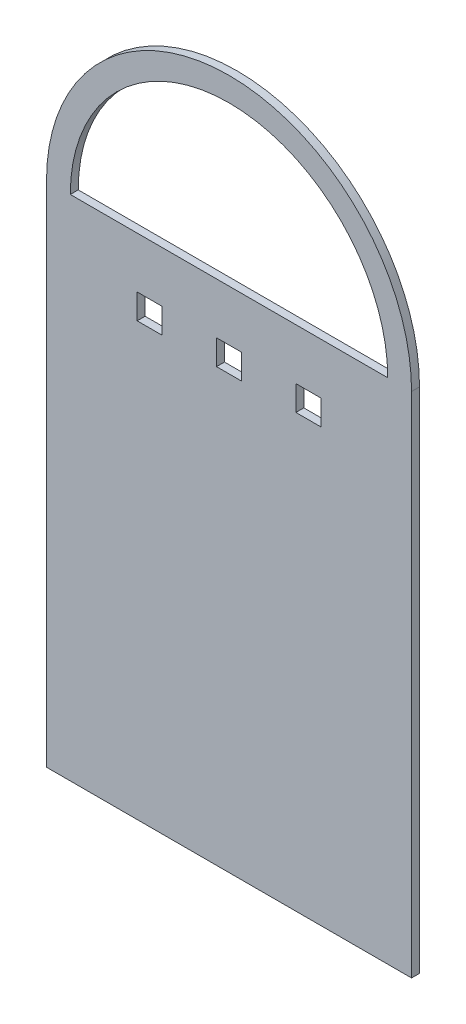
ISO-10303-21;
HEADER;
FILE_DESCRIPTION(('STEP AP214'),'2;1');
FILE_NAME('part.step','',(''),(''),'','','');
FILE_SCHEMA(('AUTOMOTIVE_DESIGN { 1 0 10303 214 1 1 1 1 }'));
ENDSEC;
DATA;
#1=APPLICATION_CONTEXT('core data for automotive mechanical design processes');
#2=APPLICATION_PROTOCOL_DEFINITION('international standard','automotive_design',2000,#1);
#3=PRODUCT_CONTEXT('',#1,'mechanical');
#4=PRODUCT('Part','Part','',(#3));
#5=PRODUCT_RELATED_PRODUCT_CATEGORY('part','',(#4));
#6=PRODUCT_DEFINITION_FORMATION('','',#4);
#7=PRODUCT_DEFINITION_CONTEXT('part definition',#1,'design');
#8=PRODUCT_DEFINITION('design','',#6,#7);
#9=PRODUCT_DEFINITION_SHAPE('','',#8);
#10=(LENGTH_UNIT() NAMED_UNIT(*) SI_UNIT(.MILLI.,.METRE.));
#11=(NAMED_UNIT(*) PLANE_ANGLE_UNIT() SI_UNIT($,.RADIAN.));
#12=(NAMED_UNIT(*) SI_UNIT($,.STERADIAN.) SOLID_ANGLE_UNIT());
#13=UNCERTAINTY_MEASURE_WITH_UNIT(LENGTH_MEASURE(1.E-05),#10,'distance_accuracy_value','');
#14=(GEOMETRIC_REPRESENTATION_CONTEXT(3) GLOBAL_UNCERTAINTY_ASSIGNED_CONTEXT((#13)) GLOBAL_UNIT_ASSIGNED_CONTEXT((#10,
#11,#12)) REPRESENTATION_CONTEXT('',''));
#15=CARTESIAN_POINT('',(0.,0.,0.));
#16=DIRECTION('',(0.,0.,1.));
#17=DIRECTION('',(1.,0.,0.));
#18=AXIS2_PLACEMENT_3D('',#15,#16,#17);
#19=CARTESIAN_POINT('',(73.025,203.2,3.175));
#20=DIRECTION('',(0.,0.,-1.));
#21=DIRECTION('',(-1.,0.,0.));
#22=AXIS2_PLACEMENT_3D('',#19,#20,#21);
#23=PLANE('',#22);
#24=DIRECTION('',(0.,1.,0.));
#25=VECTOR('',#24,1.);
#26=CARTESIAN_POINT('',(78.025,182.8,3.175));
#27=LINE('',#26,#25);
#28=CARTESIAN_POINT('',(78.025,172.8,3.175));
#29=VERTEX_POINT('',#28);
#30=CARTESIAN_POINT('',(78.025,182.8,3.175));
#31=VERTEX_POINT('',#30);
#32=EDGE_CURVE('E198',#29,#31,#27,.T.);
#33=ORIENTED_EDGE('',*,*,#32,.F.);
#34=DIRECTION('',(1.,0.,0.));
#35=VECTOR('',#34,1.);
#36=CARTESIAN_POINT('',(68.025,172.8,3.175));
#37=LINE('',#36,#35);
#38=CARTESIAN_POINT('',(68.025,172.8,3.175));
#39=VERTEX_POINT('',#38);
#40=EDGE_CURVE('E206',#39,#29,#37,.T.);
#41=ORIENTED_EDGE('',*,*,#40,.F.);
#42=DIRECTION('',(0.,-1.,0.));
#43=VECTOR('',#42,1.);
#44=CARTESIAN_POINT('',(68.025,182.8,3.175));
#45=LINE('',#44,#43);
#46=CARTESIAN_POINT('',(68.025,182.8,3.175));
#47=VERTEX_POINT('',#46);
#48=EDGE_CURVE('E203',#47,#39,#45,.T.);
#49=ORIENTED_EDGE('',*,*,#48,.F.);
#50=DIRECTION('',(-1.,0.,0.));
#51=VECTOR('',#50,1.);
#52=CARTESIAN_POINT('',(68.025,182.8,3.175));
#53=LINE('',#52,#51);
#54=EDGE_CURVE('E200',#31,#47,#53,.T.);
#55=ORIENTED_EDGE('',*,*,#54,.F.);
#56=EDGE_LOOP('',(#33,#41,#49,#55));
#57=FACE_BOUND('',#56,.T.);
#58=CARTESIAN_POINT('',(73.025,203.2,3.175));
#59=DIRECTION('',(0.,0.,1.));
#60=DIRECTION('',(-1.,0.,0.));
#61=AXIS2_PLACEMENT_3D('',#58,#59,#60);
#62=CIRCLE('',#61,63.5);
#63=CARTESIAN_POINT('',(136.525,203.2,3.175));
#64=VERTEX_POINT('',#63);
#65=CARTESIAN_POINT('',(9.52499999999999,203.2,3.175));
#66=VERTEX_POINT('',#65);
#67=EDGE_CURVE('E260',#64,#66,#62,.T.);
#68=ORIENTED_EDGE('',*,*,#67,.F.);
#69=DIRECTION('',(1.,0.,0.));
#70=VECTOR('',#69,1.);
#71=CARTESIAN_POINT('',(9.52499999999999,203.2,3.175));
#72=LINE('',#71,#70);
#73=EDGE_CURVE('E263',#66,#64,#72,.T.);
#74=ORIENTED_EDGE('',*,*,#73,.F.);
#75=EDGE_LOOP('',(#68,#74));
#76=FACE_BOUND('',#75,.T.);
#77=DIRECTION('',(0.,-1.,0.));
#78=VECTOR('',#77,1.);
#79=CARTESIAN_POINT('',(0.,203.2,3.175));
#80=LINE('',#79,#78);
#81=CARTESIAN_POINT('',(0.,203.2,3.175));
#82=VERTEX_POINT('',#81);
#83=CARTESIAN_POINT('',(0.,0.,3.175));
#84=VERTEX_POINT('',#83);
#85=EDGE_CURVE('E277',#82,#84,#80,.T.);
#86=ORIENTED_EDGE('',*,*,#85,.T.);
#87=DIRECTION('',(1.,0.,0.));
#88=VECTOR('',#87,1.);
#89=CARTESIAN_POINT('',(0.,0.,3.175));
#90=LINE('',#89,#88);
#91=CARTESIAN_POINT('',(146.05,0.,3.175));
#92=VERTEX_POINT('',#91);
#93=EDGE_CURVE('E280',#84,#92,#90,.T.);
#94=ORIENTED_EDGE('',*,*,#93,.T.);
#95=DIRECTION('',(0.,1.,0.));
#96=VECTOR('',#95,1.);
#97=CARTESIAN_POINT('',(146.05,0.,3.175));
#98=LINE('',#97,#96);
#99=CARTESIAN_POINT('',(146.05,203.2,3.175));
#100=VERTEX_POINT('',#99);
#101=EDGE_CURVE('E283',#92,#100,#98,.T.);
#102=ORIENTED_EDGE('',*,*,#101,.T.);
#103=CARTESIAN_POINT('',(73.025,203.2,3.175));
#104=DIRECTION('',(0.,0.,1.));
#105=DIRECTION('',(-1.,0.,0.));
#106=AXIS2_PLACEMENT_3D('',#103,#104,#105);
#107=CIRCLE('',#106,73.025);
#108=EDGE_CURVE('E285',#100,#82,#107,.T.);
#109=ORIENTED_EDGE('',*,*,#108,.T.);
#110=EDGE_LOOP('',(#86,#94,#102,#109));
#111=FACE_BOUND('',#110,.T.);
#112=DIRECTION('',(0.,1.,0.));
#113=VECTOR('',#112,1.);
#114=CARTESIAN_POINT('',(46.275,182.8,3.175));
#115=LINE('',#114,#113);
#116=CARTESIAN_POINT('',(46.275,172.8,3.175));
#117=VERTEX_POINT('',#116);
#118=CARTESIAN_POINT('',(46.275,182.8,3.175));
#119=VERTEX_POINT('',#118);
#120=EDGE_CURVE('E229',#117,#119,#115,.T.);
#121=ORIENTED_EDGE('',*,*,#120,.F.);
#122=DIRECTION('',(1.,0.,0.));
#123=VECTOR('',#122,1.);
#124=CARTESIAN_POINT('',(36.275,172.8,3.175));
#125=LINE('',#124,#123);
#126=CARTESIAN_POINT('',(36.275,172.8,3.175));
#127=VERTEX_POINT('',#126);
#128=EDGE_CURVE('E237',#127,#117,#125,.T.);
#129=ORIENTED_EDGE('',*,*,#128,.F.);
#130=DIRECTION('',(0.,-1.,0.));
#131=VECTOR('',#130,1.);
#132=CARTESIAN_POINT('',(36.275,182.8,3.175));
#133=LINE('',#132,#131);
#134=CARTESIAN_POINT('',(36.275,182.8,3.175));
#135=VERTEX_POINT('',#134);
#136=EDGE_CURVE('E234',#135,#127,#133,.T.);
#137=ORIENTED_EDGE('',*,*,#136,.F.);
#138=DIRECTION('',(-1.,0.,0.));
#139=VECTOR('',#138,1.);
#140=CARTESIAN_POINT('',(36.275,182.8,3.175));
#141=LINE('',#140,#139);
#142=EDGE_CURVE('E231',#119,#135,#141,.T.);
#143=ORIENTED_EDGE('',*,*,#142,.F.);
#144=EDGE_LOOP('',(#121,#129,#137,#143));
#145=FACE_BOUND('',#144,.T.);
#146=DIRECTION('',(0.,1.,0.));
#147=VECTOR('',#146,1.);
#148=CARTESIAN_POINT('',(109.775000000004,182.8,3.175));
#149=LINE('',#148,#147);
#150=CARTESIAN_POINT('',(109.775000000004,172.8,3.175));
#151=VERTEX_POINT('',#150);
#152=CARTESIAN_POINT('',(109.775000000004,182.8,3.175));
#153=VERTEX_POINT('',#152);
#154=EDGE_CURVE('E162',#151,#153,#149,.T.);
#155=ORIENTED_EDGE('',*,*,#154,.F.);
#156=DIRECTION('',(1.,0.,0.));
#157=VECTOR('',#156,1.);
#158=CARTESIAN_POINT('',(99.7750000000042,172.8,3.175));
#159=LINE('',#158,#157);
#160=CARTESIAN_POINT('',(99.7750000000042,172.8,3.175));
#161=VERTEX_POINT('',#160);
#162=EDGE_CURVE('E184',#161,#151,#159,.T.);
#163=ORIENTED_EDGE('',*,*,#162,.F.);
#164=DIRECTION('',(0.,-1.,0.));
#165=VECTOR('',#164,1.);
#166=CARTESIAN_POINT('',(99.7750000000042,182.8,3.175));
#167=LINE('',#166,#165);
#168=CARTESIAN_POINT('',(99.7750000000042,182.8,3.175));
#169=VERTEX_POINT('',#168);
#170=EDGE_CURVE('E182',#169,#161,#167,.T.);
#171=ORIENTED_EDGE('',*,*,#170,.F.);
#172=DIRECTION('',(-1.,0.,0.));
#173=VECTOR('',#172,1.);
#174=CARTESIAN_POINT('',(99.7750000000042,182.8,3.175));
#175=LINE('',#174,#173);
#176=EDGE_CURVE('E170',#153,#169,#175,.T.);
#177=ORIENTED_EDGE('',*,*,#176,.F.);
#178=EDGE_LOOP('',(#155,#163,#171,#177));
#179=FACE_BOUND('',#178,.T.);
#180=ADVANCED_FACE('F37',(#57,#76,#111,#145,#179),#23,.F.);
#181=CARTESIAN_POINT('',(73.025,203.2,0.));
#182=DIRECTION('',(0.,0.,-1.));
#183=DIRECTION('',(-1.,0.,0.));
#184=AXIS2_PLACEMENT_3D('',#181,#182,#183);
#185=PLANE('',#184);
#186=DIRECTION('',(0.,-1.,0.));
#187=VECTOR('',#186,1.);
#188=CARTESIAN_POINT('',(0.,203.2,0.));
#189=LINE('',#188,#187);
#190=CARTESIAN_POINT('',(0.,203.2,0.));
#191=VERTEX_POINT('',#190);
#192=CARTESIAN_POINT('',(0.,0.,0.));
#193=VERTEX_POINT('',#192);
#194=EDGE_CURVE('E276',#191,#193,#189,.T.);
#195=ORIENTED_EDGE('',*,*,#194,.F.);
#196=CARTESIAN_POINT('',(73.025,203.2,0.));
#197=DIRECTION('',(0.,0.,1.));
#198=DIRECTION('',(-1.,0.,0.));
#199=AXIS2_PLACEMENT_3D('',#196,#197,#198);
#200=CIRCLE('',#199,73.025);
#201=CARTESIAN_POINT('',(146.05,203.2,0.));
#202=VERTEX_POINT('',#201);
#203=EDGE_CURVE('E281',#202,#191,#200,.T.);
#204=ORIENTED_EDGE('',*,*,#203,.F.);
#205=DIRECTION('',(0.,1.,0.));
#206=VECTOR('',#205,1.);
#207=CARTESIAN_POINT('',(146.05,0.,0.));
#208=LINE('',#207,#206);
#209=CARTESIAN_POINT('',(146.05,0.,0.));
#210=VERTEX_POINT('',#209);
#211=EDGE_CURVE('E292',#210,#202,#208,.T.);
#212=ORIENTED_EDGE('',*,*,#211,.F.);
#213=DIRECTION('',(1.,0.,0.));
#214=VECTOR('',#213,1.);
#215=CARTESIAN_POINT('',(0.,0.,0.));
#216=LINE('',#215,#214);
#217=EDGE_CURVE('E290',#193,#210,#216,.T.);
#218=ORIENTED_EDGE('',*,*,#217,.F.);
#219=EDGE_LOOP('',(#195,#204,#212,#218));
#220=FACE_BOUND('',#219,.T.);
#221=DIRECTION('',(1.,0.,0.));
#222=VECTOR('',#221,1.);
#223=CARTESIAN_POINT('',(9.52499999999999,203.2,0.));
#224=LINE('',#223,#222);
#225=CARTESIAN_POINT('',(9.52499999999999,203.2,0.));
#226=VERTEX_POINT('',#225);
#227=CARTESIAN_POINT('',(136.525,203.2,0.));
#228=VERTEX_POINT('',#227);
#229=EDGE_CURVE('E264',#226,#228,#224,.T.);
#230=ORIENTED_EDGE('',*,*,#229,.T.);
#231=CARTESIAN_POINT('',(73.025,203.2,0.));
#232=DIRECTION('',(0.,0.,1.));
#233=DIRECTION('',(-1.,0.,0.));
#234=AXIS2_PLACEMENT_3D('',#231,#232,#233);
#235=CIRCLE('',#234,63.5);
#236=EDGE_CURVE('E259',#228,#226,#235,.T.);
#237=ORIENTED_EDGE('',*,*,#236,.T.);
#238=EDGE_LOOP('',(#230,#237));
#239=FACE_BOUND('',#238,.T.);
#240=DIRECTION('',(1.,0.,0.));
#241=VECTOR('',#240,1.);
#242=CARTESIAN_POINT('',(36.275,172.8,0.));
#243=LINE('',#242,#241);
#244=CARTESIAN_POINT('',(36.275,172.8,0.));
#245=VERTEX_POINT('',#244);
#246=CARTESIAN_POINT('',(46.275,172.8,0.));
#247=VERTEX_POINT('',#246);
#248=EDGE_CURVE('E232',#245,#247,#243,.T.);
#249=ORIENTED_EDGE('',*,*,#248,.T.);
#250=DIRECTION('',(0.,1.,0.));
#251=VECTOR('',#250,1.);
#252=CARTESIAN_POINT('',(46.275,182.8,0.));
#253=LINE('',#252,#251);
#254=CARTESIAN_POINT('',(46.275,182.8,0.));
#255=VERTEX_POINT('',#254);
#256=EDGE_CURVE('E228',#247,#255,#253,.T.);
#257=ORIENTED_EDGE('',*,*,#256,.T.);
#258=DIRECTION('',(-1.,0.,0.));
#259=VECTOR('',#258,1.);
#260=CARTESIAN_POINT('',(36.275,182.8,0.));
#261=LINE('',#260,#259);
#262=CARTESIAN_POINT('',(36.275,182.8,0.));
#263=VERTEX_POINT('',#262);
#264=EDGE_CURVE('E242',#255,#263,#261,.T.);
#265=ORIENTED_EDGE('',*,*,#264,.T.);
#266=DIRECTION('',(0.,-1.,0.));
#267=VECTOR('',#266,1.);
#268=CARTESIAN_POINT('',(36.275,182.8,0.));
#269=LINE('',#268,#267);
#270=EDGE_CURVE('E245',#263,#245,#269,.T.);
#271=ORIENTED_EDGE('',*,*,#270,.T.);
#272=EDGE_LOOP('',(#249,#257,#265,#271));
#273=FACE_BOUND('',#272,.T.);
#274=DIRECTION('',(1.,0.,0.));
#275=VECTOR('',#274,1.);
#276=CARTESIAN_POINT('',(68.025,172.8,0.));
#277=LINE('',#276,#275);
#278=CARTESIAN_POINT('',(68.025,172.8,0.));
#279=VERTEX_POINT('',#278);
#280=CARTESIAN_POINT('',(78.025,172.8,0.));
#281=VERTEX_POINT('',#280);
#282=EDGE_CURVE('E201',#279,#281,#277,.T.);
#283=ORIENTED_EDGE('',*,*,#282,.T.);
#284=DIRECTION('',(0.,1.,0.));
#285=VECTOR('',#284,1.);
#286=CARTESIAN_POINT('',(78.025,182.8,0.));
#287=LINE('',#286,#285);
#288=CARTESIAN_POINT('',(78.025,182.8,0.));
#289=VERTEX_POINT('',#288);
#290=EDGE_CURVE('E178',#281,#289,#287,.T.);
#291=ORIENTED_EDGE('',*,*,#290,.T.);
#292=DIRECTION('',(-1.,0.,0.));
#293=VECTOR('',#292,1.);
#294=CARTESIAN_POINT('',(68.025,182.8,0.));
#295=LINE('',#294,#293);
#296=CARTESIAN_POINT('',(68.025,182.8,0.));
#297=VERTEX_POINT('',#296);
#298=EDGE_CURVE('E211',#289,#297,#295,.T.);
#299=ORIENTED_EDGE('',*,*,#298,.T.);
#300=DIRECTION('',(0.,-1.,0.));
#301=VECTOR('',#300,1.);
#302=CARTESIAN_POINT('',(68.025,182.8,0.));
#303=LINE('',#302,#301);
#304=EDGE_CURVE('E214',#297,#279,#303,.T.);
#305=ORIENTED_EDGE('',*,*,#304,.T.);
#306=EDGE_LOOP('',(#283,#291,#299,#305));
#307=FACE_BOUND('',#306,.T.);
#308=DIRECTION('',(1.,0.,0.));
#309=VECTOR('',#308,1.);
#310=CARTESIAN_POINT('',(99.7750000000042,172.8,0.));
#311=LINE('',#310,#309);
#312=CARTESIAN_POINT('',(99.7750000000042,172.8,0.));
#313=VERTEX_POINT('',#312);
#314=CARTESIAN_POINT('',(109.775000000004,172.8,0.));
#315=VERTEX_POINT('',#314);
#316=EDGE_CURVE('E171',#313,#315,#311,.T.);
#317=ORIENTED_EDGE('',*,*,#316,.T.);
#318=DIRECTION('',(0.,1.,0.));
#319=VECTOR('',#318,1.);
#320=CARTESIAN_POINT('',(109.775000000004,182.8,0.));
#321=LINE('',#320,#319);
#322=CARTESIAN_POINT('',(109.775000000004,182.8,0.));
#323=VERTEX_POINT('',#322);
#324=EDGE_CURVE('E60',#315,#323,#321,.T.);
#325=ORIENTED_EDGE('',*,*,#324,.T.);
#326=DIRECTION('',(-1.,0.,0.));
#327=VECTOR('',#326,1.);
#328=CARTESIAN_POINT('',(99.7750000000042,182.8,0.));
#329=LINE('',#328,#327);
#330=CARTESIAN_POINT('',(99.7750000000042,182.8,0.));
#331=VERTEX_POINT('',#330);
#332=EDGE_CURVE('E177',#323,#331,#329,.T.);
#333=ORIENTED_EDGE('',*,*,#332,.T.);
#334=DIRECTION('',(0.,-1.,0.));
#335=VECTOR('',#334,1.);
#336=CARTESIAN_POINT('',(99.7750000000042,182.8,0.));
#337=LINE('',#336,#335);
#338=EDGE_CURVE('E190',#331,#313,#337,.T.);
#339=ORIENTED_EDGE('',*,*,#338,.T.);
#340=EDGE_LOOP('',(#317,#325,#333,#339));
#341=FACE_BOUND('',#340,.T.);
#342=ADVANCED_FACE('F310',(#220,#239,#273,#307,#341),#185,.T.);
#343=CARTESIAN_POINT('',(0.,203.2,3.175));
#344=DIRECTION('',(1.,0.,0.));
#345=DIRECTION('',(0.,1.,0.));
#346=AXIS2_PLACEMENT_3D('',#343,#344,#345);
#347=PLANE('',#346);
#348=ORIENTED_EDGE('',*,*,#194,.T.);
#349=DIRECTION('',(0.,0.,-1.));
#350=VECTOR('',#349,1.);
#351=CARTESIAN_POINT('',(0.,0.,3.175));
#352=LINE('',#351,#350);
#353=EDGE_CURVE('E11',#84,#193,#352,.T.);
#354=ORIENTED_EDGE('',*,*,#353,.F.);
#355=ORIENTED_EDGE('',*,*,#85,.F.);
#356=DIRECTION('',(0.,0.,-1.));
#357=VECTOR('',#356,1.);
#358=CARTESIAN_POINT('',(0.,203.2,3.175));
#359=LINE('',#358,#357);
#360=EDGE_CURVE('E287',#82,#191,#359,.T.);
#361=ORIENTED_EDGE('',*,*,#360,.T.);
#362=EDGE_LOOP('',(#348,#354,#355,#361));
#363=FACE_BOUND('',#362,.T.);
#364=ADVANCED_FACE('F39',(#363),#347,.F.);
#365=CARTESIAN_POINT('',(0.,0.,3.175));
#366=DIRECTION('',(0.,1.,0.));
#367=DIRECTION('',(0.,0.,1.));
#368=AXIS2_PLACEMENT_3D('',#365,#366,#367);
#369=PLANE('',#368);
#370=ORIENTED_EDGE('',*,*,#217,.T.);
#371=DIRECTION('',(0.,0.,-1.));
#372=VECTOR('',#371,1.);
#373=CARTESIAN_POINT('',(146.05,0.,3.175));
#374=LINE('',#373,#372);
#375=EDGE_CURVE('E45',#92,#210,#374,.T.);
#376=ORIENTED_EDGE('',*,*,#375,.F.);
#377=ORIENTED_EDGE('',*,*,#93,.F.);
#378=ORIENTED_EDGE('',*,*,#353,.T.);
#379=EDGE_LOOP('',(#370,#376,#377,#378));
#380=FACE_BOUND('',#379,.T.);
#381=ADVANCED_FACE('F321',(#380),#369,.F.);
#382=CARTESIAN_POINT('',(146.05,0.,3.175));
#383=DIRECTION('',(-1.,0.,0.));
#384=DIRECTION('',(0.,-1.,0.));
#385=AXIS2_PLACEMENT_3D('',#382,#383,#384);
#386=PLANE('',#385);
#387=ORIENTED_EDGE('',*,*,#211,.T.);
#388=DIRECTION('',(0.,0.,-1.));
#389=VECTOR('',#388,1.);
#390=CARTESIAN_POINT('',(146.05,203.2,3.175));
#391=LINE('',#390,#389);
#392=EDGE_CURVE('E297',#100,#202,#391,.T.);
#393=ORIENTED_EDGE('',*,*,#392,.F.);
#394=ORIENTED_EDGE('',*,*,#101,.F.);
#395=ORIENTED_EDGE('',*,*,#375,.T.);
#396=EDGE_LOOP('',(#387,#393,#394,#395));
#397=FACE_BOUND('',#396,.T.);
#398=ADVANCED_FACE('F304',(#397),#386,.F.);
#399=CARTESIAN_POINT('',(73.025,203.2,3.175));
#400=DIRECTION('',(0.,0.,-1.));
#401=DIRECTION('',(-1.,0.,0.));
#402=AXIS2_PLACEMENT_3D('',#399,#400,#401);
#403=CYLINDRICAL_SURFACE('',#402,73.025);
#404=ORIENTED_EDGE('',*,*,#203,.T.);
#405=ORIENTED_EDGE('',*,*,#360,.F.);
#406=ORIENTED_EDGE('',*,*,#108,.F.);
#407=ORIENTED_EDGE('',*,*,#392,.T.);
#408=EDGE_LOOP('',(#404,#405,#406,#407));
#409=FACE_BOUND('',#408,.T.);
#410=ADVANCED_FACE('F314',(#409),#403,.T.);
#411=CARTESIAN_POINT('',(73.025,203.2,3.175));
#412=DIRECTION('',(0.,0.,-1.));
#413=DIRECTION('',(-1.,0.,0.));
#414=AXIS2_PLACEMENT_3D('',#411,#412,#413);
#415=CYLINDRICAL_SURFACE('',#414,63.5);
#416=ORIENTED_EDGE('',*,*,#236,.F.);
#417=DIRECTION('',(0.,0.,-1.));
#418=VECTOR('',#417,1.);
#419=CARTESIAN_POINT('',(136.525,203.2,3.175));
#420=LINE('',#419,#418);
#421=EDGE_CURVE('E266',#64,#228,#420,.T.);
#422=ORIENTED_EDGE('',*,*,#421,.F.);
#423=ORIENTED_EDGE('',*,*,#67,.T.);
#424=DIRECTION('',(0.,0.,-1.));
#425=VECTOR('',#424,1.);
#426=CARTESIAN_POINT('',(9.52499999999999,203.2,3.175));
#427=LINE('',#426,#425);
#428=EDGE_CURVE('E273',#66,#226,#427,.T.);
#429=ORIENTED_EDGE('',*,*,#428,.T.);
#430=EDGE_LOOP('',(#416,#422,#423,#429));
#431=FACE_BOUND('',#430,.T.);
#432=ADVANCED_FACE('F338',(#431),#415,.F.);
#433=CARTESIAN_POINT('',(9.52499999999999,203.2,3.175));
#434=DIRECTION('',(0.,1.,0.));
#435=DIRECTION('',(-1.,0.,0.));
#436=AXIS2_PLACEMENT_3D('',#433,#434,#435);
#437=PLANE('',#436);
#438=ORIENTED_EDGE('',*,*,#229,.F.);
#439=ORIENTED_EDGE('',*,*,#428,.F.);
#440=ORIENTED_EDGE('',*,*,#73,.T.);
#441=ORIENTED_EDGE('',*,*,#421,.T.);
#442=EDGE_LOOP('',(#438,#439,#440,#441));
#443=FACE_BOUND('',#442,.T.);
#444=ADVANCED_FACE('F345',(#443),#437,.T.);
#445=CARTESIAN_POINT('',(46.275,182.8,3.175));
#446=DIRECTION('',(-1.,0.,0.));
#447=DIRECTION('',(0.,0.,1.));
#448=AXIS2_PLACEMENT_3D('',#445,#446,#447);
#449=PLANE('',#448);
#450=ORIENTED_EDGE('',*,*,#256,.F.);
#451=DIRECTION('',(0.,0.,-1.));
#452=VECTOR('',#451,1.);
#453=CARTESIAN_POINT('',(46.275,172.8,3.175));
#454=LINE('',#453,#452);
#455=EDGE_CURVE('E239',#117,#247,#454,.T.);
#456=ORIENTED_EDGE('',*,*,#455,.F.);
#457=ORIENTED_EDGE('',*,*,#120,.T.);
#458=DIRECTION('',(0.,0.,-1.));
#459=VECTOR('',#458,1.);
#460=CARTESIAN_POINT('',(46.275,182.8,3.175));
#461=LINE('',#460,#459);
#462=EDGE_CURVE('E256',#119,#255,#461,.T.);
#463=ORIENTED_EDGE('',*,*,#462,.T.);
#464=EDGE_LOOP('',(#450,#456,#457,#463));
#465=FACE_BOUND('',#464,.T.);
#466=ADVANCED_FACE('F350',(#465),#449,.T.);
#467=CARTESIAN_POINT('',(36.275,182.8,3.175));
#468=DIRECTION('',(0.,-1.,0.));
#469=DIRECTION('',(0.,0.,-1.));
#470=AXIS2_PLACEMENT_3D('',#467,#468,#469);
#471=PLANE('',#470);
#472=ORIENTED_EDGE('',*,*,#264,.F.);
#473=ORIENTED_EDGE('',*,*,#462,.F.);
#474=ORIENTED_EDGE('',*,*,#142,.T.);
#475=DIRECTION('',(0.,0.,-1.));
#476=VECTOR('',#475,1.);
#477=CARTESIAN_POINT('',(36.275,182.8,3.175));
#478=LINE('',#477,#476);
#479=EDGE_CURVE('E254',#135,#263,#478,.T.);
#480=ORIENTED_EDGE('',*,*,#479,.T.);
#481=EDGE_LOOP('',(#472,#473,#474,#480));
#482=FACE_BOUND('',#481,.T.);
#483=ADVANCED_FACE('F398',(#482),#471,.T.);
#484=CARTESIAN_POINT('',(36.275,182.8,3.175));
#485=DIRECTION('',(1.,0.,0.));
#486=DIRECTION('',(0.,0.,-1.));
#487=AXIS2_PLACEMENT_3D('',#484,#485,#486);
#488=PLANE('',#487);
#489=ORIENTED_EDGE('',*,*,#270,.F.);
#490=ORIENTED_EDGE('',*,*,#479,.F.);
#491=ORIENTED_EDGE('',*,*,#136,.T.);
#492=DIRECTION('',(0.,0.,-1.));
#493=VECTOR('',#492,1.);
#494=CARTESIAN_POINT('',(36.275,172.8,3.175));
#495=LINE('',#494,#493);
#496=EDGE_CURVE('E252',#127,#245,#495,.T.);
#497=ORIENTED_EDGE('',*,*,#496,.T.);
#498=EDGE_LOOP('',(#489,#490,#491,#497));
#499=FACE_BOUND('',#498,.T.);
#500=ADVANCED_FACE('F394',(#499),#488,.T.);
#501=CARTESIAN_POINT('',(36.275,172.8,3.175));
#502=DIRECTION('',(0.,1.,0.));
#503=DIRECTION('',(0.,0.,1.));
#504=AXIS2_PLACEMENT_3D('',#501,#502,#503);
#505=PLANE('',#504);
#506=ORIENTED_EDGE('',*,*,#248,.F.);
#507=ORIENTED_EDGE('',*,*,#496,.F.);
#508=ORIENTED_EDGE('',*,*,#128,.T.);
#509=ORIENTED_EDGE('',*,*,#455,.T.);
#510=EDGE_LOOP('',(#506,#507,#508,#509));
#511=FACE_BOUND('',#510,.T.);
#512=ADVANCED_FACE('F390',(#511),#505,.T.);
#513=CARTESIAN_POINT('',(78.025,182.8,3.175));
#514=DIRECTION('',(-1.,0.,0.));
#515=DIRECTION('',(0.,0.,1.));
#516=AXIS2_PLACEMENT_3D('',#513,#514,#515);
#517=PLANE('',#516);
#518=ORIENTED_EDGE('',*,*,#290,.F.);
#519=DIRECTION('',(0.,0.,-1.));
#520=VECTOR('',#519,1.);
#521=CARTESIAN_POINT('',(78.025,172.8,3.175));
#522=LINE('',#521,#520);
#523=EDGE_CURVE('E208',#29,#281,#522,.T.);
#524=ORIENTED_EDGE('',*,*,#523,.F.);
#525=ORIENTED_EDGE('',*,*,#32,.T.);
#526=DIRECTION('',(0.,0.,-1.));
#527=VECTOR('',#526,1.);
#528=CARTESIAN_POINT('',(78.025,182.8,3.175));
#529=LINE('',#528,#527);
#530=EDGE_CURVE('E225',#31,#289,#529,.T.);
#531=ORIENTED_EDGE('',*,*,#530,.T.);
#532=EDGE_LOOP('',(#518,#524,#525,#531));
#533=FACE_BOUND('',#532,.T.);
#534=ADVANCED_FACE('F386',(#533),#517,.T.);
#535=CARTESIAN_POINT('',(68.025,182.8,3.175));
#536=DIRECTION('',(0.,-1.,0.));
#537=DIRECTION('',(1.,0.,0.));
#538=AXIS2_PLACEMENT_3D('',#535,#536,#537);
#539=PLANE('',#538);
#540=ORIENTED_EDGE('',*,*,#298,.F.);
#541=ORIENTED_EDGE('',*,*,#530,.F.);
#542=ORIENTED_EDGE('',*,*,#54,.T.);
#543=DIRECTION('',(0.,0.,-1.));
#544=VECTOR('',#543,1.);
#545=CARTESIAN_POINT('',(68.025,182.8,3.175));
#546=LINE('',#545,#544);
#547=EDGE_CURVE('E223',#47,#297,#546,.T.);
#548=ORIENTED_EDGE('',*,*,#547,.T.);
#549=EDGE_LOOP('',(#540,#541,#542,#548));
#550=FACE_BOUND('',#549,.T.);
#551=ADVANCED_FACE('F382',(#550),#539,.T.);
#552=CARTESIAN_POINT('',(68.025,182.8,3.175));
#553=DIRECTION('',(1.,0.,0.));
#554=DIRECTION('',(0.,0.,-1.));
#555=AXIS2_PLACEMENT_3D('',#552,#553,#554);
#556=PLANE('',#555);
#557=ORIENTED_EDGE('',*,*,#304,.F.);
#558=ORIENTED_EDGE('',*,*,#547,.F.);
#559=ORIENTED_EDGE('',*,*,#48,.T.);
#560=DIRECTION('',(0.,0.,-1.));
#561=VECTOR('',#560,1.);
#562=CARTESIAN_POINT('',(68.025,172.8,3.175));
#563=LINE('',#562,#561);
#564=EDGE_CURVE('E221',#39,#279,#563,.T.);
#565=ORIENTED_EDGE('',*,*,#564,.T.);
#566=EDGE_LOOP('',(#557,#558,#559,#565));
#567=FACE_BOUND('',#566,.T.);
#568=ADVANCED_FACE('F378',(#567),#556,.T.);
#569=CARTESIAN_POINT('',(68.025,172.8,3.175));
#570=DIRECTION('',(0.,1.,0.));
#571=DIRECTION('',(0.,0.,1.));
#572=AXIS2_PLACEMENT_3D('',#569,#570,#571);
#573=PLANE('',#572);
#574=ORIENTED_EDGE('',*,*,#282,.F.);
#575=ORIENTED_EDGE('',*,*,#564,.F.);
#576=ORIENTED_EDGE('',*,*,#40,.T.);
#577=ORIENTED_EDGE('',*,*,#523,.T.);
#578=EDGE_LOOP('',(#574,#575,#576,#577));
#579=FACE_BOUND('',#578,.T.);
#580=ADVANCED_FACE('F375',(#579),#573,.T.);
#581=CARTESIAN_POINT('',(109.775000000004,182.8,3.175));
#582=DIRECTION('',(-1.,0.,0.));
#583=DIRECTION('',(0.,0.,1.));
#584=AXIS2_PLACEMENT_3D('',#581,#582,#583);
#585=PLANE('',#584);
#586=ORIENTED_EDGE('',*,*,#324,.F.);
#587=DIRECTION('',(0.,0.,-1.));
#588=VECTOR('',#587,1.);
#589=CARTESIAN_POINT('',(109.775000000004,172.8,3.175));
#590=LINE('',#589,#588);
#591=EDGE_CURVE('E166',#151,#315,#590,.T.);
#592=ORIENTED_EDGE('',*,*,#591,.F.);
#593=ORIENTED_EDGE('',*,*,#154,.T.);
#594=DIRECTION('',(0.,0.,-1.));
#595=VECTOR('',#594,1.);
#596=CARTESIAN_POINT('',(109.775000000004,182.8,3.175));
#597=LINE('',#596,#595);
#598=EDGE_CURVE('E165',#153,#323,#597,.T.);
#599=ORIENTED_EDGE('',*,*,#598,.T.);
#600=EDGE_LOOP('',(#586,#592,#593,#599));
#601=FACE_BOUND('',#600,.T.);
#602=ADVANCED_FACE('F164',(#601),#585,.T.);
#603=CARTESIAN_POINT('',(99.7750000000042,182.8,3.175));
#604=DIRECTION('',(0.,-1.,0.));
#605=DIRECTION('',(1.,0.,0.));
#606=AXIS2_PLACEMENT_3D('',#603,#604,#605);
#607=PLANE('',#606);
#608=ORIENTED_EDGE('',*,*,#332,.F.);
#609=ORIENTED_EDGE('',*,*,#598,.F.);
#610=ORIENTED_EDGE('',*,*,#176,.T.);
#611=DIRECTION('',(0.,0.,-1.));
#612=VECTOR('',#611,1.);
#613=CARTESIAN_POINT('',(99.7750000000042,182.8,3.175));
#614=LINE('',#613,#612);
#615=EDGE_CURVE('E179',#169,#331,#614,.T.);
#616=ORIENTED_EDGE('',*,*,#615,.T.);
#617=EDGE_LOOP('',(#608,#609,#610,#616));
#618=FACE_BOUND('',#617,.T.);
#619=ADVANCED_FACE('F174',(#618),#607,.T.);
#620=CARTESIAN_POINT('',(99.7750000000042,182.8,3.175));
#621=DIRECTION('',(1.,0.,0.));
#622=DIRECTION('',(0.,0.,-1.));
#623=AXIS2_PLACEMENT_3D('',#620,#621,#622);
#624=PLANE('',#623);
#625=ORIENTED_EDGE('',*,*,#338,.F.);
#626=ORIENTED_EDGE('',*,*,#615,.F.);
#627=ORIENTED_EDGE('',*,*,#170,.T.);
#628=DIRECTION('',(0.,0.,-1.));
#629=VECTOR('',#628,1.);
#630=CARTESIAN_POINT('',(99.7750000000042,172.8,3.175));
#631=LINE('',#630,#629);
#632=EDGE_CURVE('E52',#161,#313,#631,.T.);
#633=ORIENTED_EDGE('',*,*,#632,.T.);
#634=EDGE_LOOP('',(#625,#626,#627,#633));
#635=FACE_BOUND('',#634,.T.);
#636=ADVANCED_FACE('F363',(#635),#624,.T.);
#637=CARTESIAN_POINT('',(99.7750000000042,172.8,3.175));
#638=DIRECTION('',(0.,1.,0.));
#639=DIRECTION('',(0.,0.,1.));
#640=AXIS2_PLACEMENT_3D('',#637,#638,#639);
#641=PLANE('',#640);
#642=ORIENTED_EDGE('',*,*,#316,.F.);
#643=ORIENTED_EDGE('',*,*,#632,.F.);
#644=ORIENTED_EDGE('',*,*,#162,.T.);
#645=ORIENTED_EDGE('',*,*,#591,.T.);
#646=EDGE_LOOP('',(#642,#643,#644,#645));
#647=FACE_BOUND('',#646,.T.);
#648=ADVANCED_FACE('F361',(#647),#641,.T.);
#649=CLOSED_SHELL('',(#180,#342,#364,#381,#398,#410,#432,#444,#466,#483,#500,#512,#534,#551,
#568,#580,#602,#619,#636,#648));
#650=MANIFOLD_SOLID_BREP('B2',#649);
#651=ADVANCED_BREP_SHAPE_REPRESENTATION('',(#18,#650),#14);
#652=SHAPE_DEFINITION_REPRESENTATION(#9,#651);
ENDSEC;
END-ISO-10303-21;
